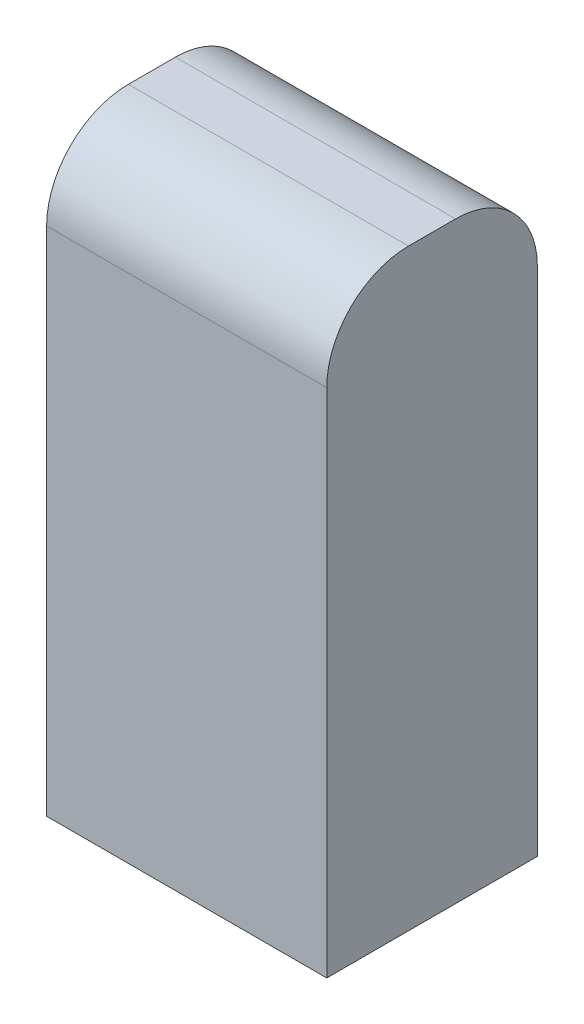
ISO-10303-21;
HEADER;
FILE_DESCRIPTION(('STEP AP214'),'2;1');
FILE_NAME('part.step','',(''),(''),'','','');
FILE_SCHEMA(('AUTOMOTIVE_DESIGN { 1 0 10303 214 1 1 1 1 }'));
ENDSEC;
DATA;
#1=APPLICATION_CONTEXT('core data for automotive mechanical design processes');
#2=APPLICATION_PROTOCOL_DEFINITION('international standard','automotive_design',2000,#1);
#3=PRODUCT_CONTEXT('',#1,'mechanical');
#4=PRODUCT('Part','Part','',(#3));
#5=PRODUCT_RELATED_PRODUCT_CATEGORY('part','',(#4));
#6=PRODUCT_DEFINITION_FORMATION('','',#4);
#7=PRODUCT_DEFINITION_CONTEXT('part definition',#1,'design');
#8=PRODUCT_DEFINITION('design','',#6,#7);
#9=PRODUCT_DEFINITION_SHAPE('','',#8);
#10=(LENGTH_UNIT() NAMED_UNIT(*) SI_UNIT(.MILLI.,.METRE.));
#11=(NAMED_UNIT(*) PLANE_ANGLE_UNIT() SI_UNIT($,.RADIAN.));
#12=(NAMED_UNIT(*) SI_UNIT($,.STERADIAN.) SOLID_ANGLE_UNIT());
#13=UNCERTAINTY_MEASURE_WITH_UNIT(LENGTH_MEASURE(1.E-05),#10,'distance_accuracy_value','');
#14=(GEOMETRIC_REPRESENTATION_CONTEXT(3) GLOBAL_UNCERTAINTY_ASSIGNED_CONTEXT((#13)) GLOBAL_UNIT_ASSIGNED_CONTEXT((#10,
#11,#12)) REPRESENTATION_CONTEXT('',''));
#15=CARTESIAN_POINT('',(0.,0.,0.));
#16=DIRECTION('',(0.,0.,1.));
#17=DIRECTION('',(1.,0.,0.));
#18=AXIS2_PLACEMENT_3D('',#15,#16,#17);
#19=CARTESIAN_POINT('',(17.399,73.66,13.081));
#20=DIRECTION('',(-1.,0.,0.));
#21=DIRECTION('',(0.,0.,1.));
#22=AXIS2_PLACEMENT_3D('',#19,#20,#21);
#23=PLANE('',#22);
#24=DIRECTION('',(0.,-1.,0.));
#25=VECTOR('',#24,1.);
#26=CARTESIAN_POINT('',(17.399,73.66,-13.081));
#27=LINE('',#26,#25);
#28=CARTESIAN_POINT('',(17.399,63.5,-13.081));
#29=VERTEX_POINT('',#28);
#30=CARTESIAN_POINT('',(17.399,0.,-13.081));
#31=VERTEX_POINT('',#30);
#32=EDGE_CURVE('E86',#29,#31,#27,.T.);
#33=ORIENTED_EDGE('',*,*,#32,.F.);
#34=CARTESIAN_POINT('',(17.399,63.5,-2.921));
#35=DIRECTION('',(-1.,0.,0.));
#36=DIRECTION('',(0.,0.,1.));
#37=AXIS2_PLACEMENT_3D('',#34,#35,#36);
#38=CIRCLE('',#37,10.16);
#39=CARTESIAN_POINT('',(17.399,73.66,-2.921));
#40=VERTEX_POINT('',#39);
#41=EDGE_CURVE('E43',#29,#40,#38,.F.);
#42=ORIENTED_EDGE('',*,*,#41,.T.);
#43=DIRECTION('',(0.,0.,-1.));
#44=VECTOR('',#43,1.);
#45=CARTESIAN_POINT('',(17.399,73.66,13.081));
#46=LINE('',#45,#44);
#47=CARTESIAN_POINT('',(17.399,73.66,2.921));
#48=VERTEX_POINT('',#47);
#49=EDGE_CURVE('E114',#48,#40,#46,.T.);
#50=ORIENTED_EDGE('',*,*,#49,.F.);
#51=CARTESIAN_POINT('',(17.399,63.5,2.921));
#52=DIRECTION('',(-1.,0.,0.));
#53=DIRECTION('',(0.,0.,1.));
#54=AXIS2_PLACEMENT_3D('',#51,#52,#53);
#55=CIRCLE('',#54,10.16);
#56=CARTESIAN_POINT('',(17.399,63.5,13.081));
#57=VERTEX_POINT('',#56);
#58=EDGE_CURVE('E50',#48,#57,#55,.F.);
#59=ORIENTED_EDGE('',*,*,#58,.T.);
#60=DIRECTION('',(0.,-1.,0.));
#61=VECTOR('',#60,1.);
#62=CARTESIAN_POINT('',(17.399,73.66,13.081));
#63=LINE('',#62,#61);
#64=CARTESIAN_POINT('',(17.399,0.,13.081));
#65=VERTEX_POINT('',#64);
#66=EDGE_CURVE('E104',#57,#65,#63,.T.);
#67=ORIENTED_EDGE('',*,*,#66,.T.);
#68=DIRECTION('',(0.,0.,-1.));
#69=VECTOR('',#68,1.);
#70=CARTESIAN_POINT('',(17.399,0.,13.081));
#71=LINE('',#70,#69);
#72=EDGE_CURVE('E100',#65,#31,#71,.T.);
#73=ORIENTED_EDGE('',*,*,#72,.T.);
#74=EDGE_LOOP('',(#33,#42,#50,#59,#67,#73));
#75=FACE_BOUND('',#74,.T.);
#76=ADVANCED_FACE('F35',(#75),#23,.F.);
#77=CARTESIAN_POINT('',(-17.399,73.66,-13.081));
#78=DIRECTION('',(0.,0.,1.));
#79=DIRECTION('',(1.,0.,0.));
#80=AXIS2_PLACEMENT_3D('',#77,#78,#79);
#81=PLANE('',#80);
#82=DIRECTION('',(0.,-1.,0.));
#83=VECTOR('',#82,1.);
#84=CARTESIAN_POINT('',(-17.399,73.66,-13.081));
#85=LINE('',#84,#83);
#86=CARTESIAN_POINT('',(-17.399,63.5,-13.081));
#87=VERTEX_POINT('',#86);
#88=CARTESIAN_POINT('',(-17.399,0.,-13.081));
#89=VERTEX_POINT('',#88);
#90=EDGE_CURVE('E94',#87,#89,#85,.T.);
#91=ORIENTED_EDGE('',*,*,#90,.F.);
#92=DIRECTION('',(-1.,0.,0.));
#93=VECTOR('',#92,1.);
#94=CARTESIAN_POINT('',(-17.399,63.5,-13.081));
#95=LINE('',#94,#93);
#96=EDGE_CURVE('E58',#87,#29,#95,.F.);
#97=ORIENTED_EDGE('',*,*,#96,.T.);
#98=ORIENTED_EDGE('',*,*,#32,.T.);
#99=DIRECTION('',(-1.,0.,0.));
#100=VECTOR('',#99,1.);
#101=CARTESIAN_POINT('',(-17.399,0.,-13.081));
#102=LINE('',#101,#100);
#103=EDGE_CURVE('E89',#31,#89,#102,.T.);
#104=ORIENTED_EDGE('',*,*,#103,.T.);
#105=EDGE_LOOP('',(#91,#97,#98,#104));
#106=FACE_BOUND('',#105,.T.);
#107=ADVANCED_FACE('F88',(#106),#81,.F.);
#108=CARTESIAN_POINT('',(-17.399,73.66,13.081));
#109=DIRECTION('',(1.,0.,0.));
#110=DIRECTION('',(0.,0.,-1.));
#111=AXIS2_PLACEMENT_3D('',#108,#109,#110);
#112=PLANE('',#111);
#113=DIRECTION('',(0.,0.,1.));
#114=VECTOR('',#113,1.);
#115=CARTESIAN_POINT('',(-17.399,73.66,13.081));
#116=LINE('',#115,#114);
#117=CARTESIAN_POINT('',(-17.399,73.66,-2.921));
#118=VERTEX_POINT('',#117);
#119=CARTESIAN_POINT('',(-17.399,73.66,2.921));
#120=VERTEX_POINT('',#119);
#121=EDGE_CURVE('E108',#118,#120,#116,.T.);
#122=ORIENTED_EDGE('',*,*,#121,.F.);
#123=CARTESIAN_POINT('',(-17.399,63.5,-2.921));
#124=DIRECTION('',(1.,0.,0.));
#125=DIRECTION('',(0.,0.,-1.));
#126=AXIS2_PLACEMENT_3D('',#123,#124,#125);
#127=CIRCLE('',#126,10.16);
#128=EDGE_CURVE('E126',#118,#87,#127,.F.);
#129=ORIENTED_EDGE('',*,*,#128,.T.);
#130=ORIENTED_EDGE('',*,*,#90,.T.);
#131=DIRECTION('',(0.,0.,1.));
#132=VECTOR('',#131,1.);
#133=CARTESIAN_POINT('',(-17.399,0.,13.081));
#134=LINE('',#133,#132);
#135=CARTESIAN_POINT('',(-17.399,0.,13.081));
#136=VERTEX_POINT('',#135);
#137=EDGE_CURVE('E102',#89,#136,#134,.T.);
#138=ORIENTED_EDGE('',*,*,#137,.T.);
#139=DIRECTION('',(0.,-1.,0.));
#140=VECTOR('',#139,1.);
#141=CARTESIAN_POINT('',(-17.399,73.66,13.081));
#142=LINE('',#141,#140);
#143=CARTESIAN_POINT('',(-17.399,63.5,13.081));
#144=VERTEX_POINT('',#143);
#145=EDGE_CURVE('E116',#144,#136,#142,.T.);
#146=ORIENTED_EDGE('',*,*,#145,.F.);
#147=CARTESIAN_POINT('',(-17.399,63.5,2.921));
#148=DIRECTION('',(1.,0.,0.));
#149=DIRECTION('',(0.,0.,-1.));
#150=AXIS2_PLACEMENT_3D('',#147,#148,#149);
#151=CIRCLE('',#150,10.16);
#152=EDGE_CURVE('E124',#144,#120,#151,.F.);
#153=ORIENTED_EDGE('',*,*,#152,.T.);
#154=EDGE_LOOP('',(#122,#129,#130,#138,#146,#153));
#155=FACE_BOUND('',#154,.T.);
#156=ADVANCED_FACE('F139',(#155),#112,.F.);
#157=CARTESIAN_POINT('',(-17.399,73.66,13.081));
#158=DIRECTION('',(0.,0.,-1.));
#159=DIRECTION('',(-1.,0.,0.));
#160=AXIS2_PLACEMENT_3D('',#157,#158,#159);
#161=PLANE('',#160);
#162=ORIENTED_EDGE('',*,*,#66,.F.);
#163=DIRECTION('',(1.,0.,0.));
#164=VECTOR('',#163,1.);
#165=CARTESIAN_POINT('',(-17.399,63.5,13.081));
#166=LINE('',#165,#164);
#167=EDGE_CURVE('E11',#57,#144,#166,.F.);
#168=ORIENTED_EDGE('',*,*,#167,.T.);
#169=ORIENTED_EDGE('',*,*,#145,.T.);
#170=DIRECTION('',(1.,0.,0.));
#171=VECTOR('',#170,1.);
#172=CARTESIAN_POINT('',(-17.399,0.,13.081));
#173=LINE('',#172,#171);
#174=EDGE_CURVE('E112',#136,#65,#173,.T.);
#175=ORIENTED_EDGE('',*,*,#174,.T.);
#176=EDGE_LOOP('',(#162,#168,#169,#175));
#177=FACE_BOUND('',#176,.T.);
#178=ADVANCED_FACE('F145',(#177),#161,.F.);
#179=CARTESIAN_POINT('',(0.,73.66,0.));
#180=DIRECTION('',(0.,-1.,0.));
#181=DIRECTION('',(0.,0.,-1.));
#182=AXIS2_PLACEMENT_3D('',#179,#180,#181);
#183=PLANE('',#182);
#184=ORIENTED_EDGE('',*,*,#49,.T.);
#185=DIRECTION('',(-1.,0.,0.));
#186=VECTOR('',#185,1.);
#187=CARTESIAN_POINT('',(0.,73.66,-2.921));
#188=LINE('',#187,#186);
#189=EDGE_CURVE('E121',#40,#118,#188,.T.);
#190=ORIENTED_EDGE('',*,*,#189,.T.);
#191=ORIENTED_EDGE('',*,*,#121,.T.);
#192=DIRECTION('',(1.,0.,0.));
#193=VECTOR('',#192,1.);
#194=CARTESIAN_POINT('',(0.,73.66,2.921));
#195=LINE('',#194,#193);
#196=EDGE_CURVE('E93',#120,#48,#195,.T.);
#197=ORIENTED_EDGE('',*,*,#196,.T.);
#198=EDGE_LOOP('',(#184,#190,#191,#197));
#199=FACE_BOUND('',#198,.T.);
#200=ADVANCED_FACE('F133',(#199),#183,.F.);
#201=CARTESIAN_POINT('',(0.,0.,0.));
#202=DIRECTION('',(0.,-1.,0.));
#203=DIRECTION('',(0.,0.,-1.));
#204=AXIS2_PLACEMENT_3D('',#201,#202,#203);
#205=PLANE('',#204);
#206=ORIENTED_EDGE('',*,*,#72,.F.);
#207=ORIENTED_EDGE('',*,*,#174,.F.);
#208=ORIENTED_EDGE('',*,*,#137,.F.);
#209=ORIENTED_EDGE('',*,*,#103,.F.);
#210=EDGE_LOOP('',(#206,#207,#208,#209));
#211=FACE_BOUND('',#210,.T.);
#212=ADVANCED_FACE('F98',(#211),#205,.T.);
#213=CARTESIAN_POINT('',(0.,63.5,-2.921));
#214=DIRECTION('',(-1.,0.,0.));
#215=DIRECTION('',(0.,0.,1.));
#216=AXIS2_PLACEMENT_3D('',#213,#214,#215);
#217=CYLINDRICAL_SURFACE('',#216,10.16);
#218=ORIENTED_EDGE('',*,*,#41,.F.);
#219=ORIENTED_EDGE('',*,*,#96,.F.);
#220=ORIENTED_EDGE('',*,*,#128,.F.);
#221=ORIENTED_EDGE('',*,*,#189,.F.);
#222=EDGE_LOOP('',(#218,#219,#220,#221));
#223=FACE_BOUND('',#222,.T.);
#224=ADVANCED_FACE('F137',(#223),#217,.T.);
#225=CARTESIAN_POINT('',(0.,63.5,2.921));
#226=DIRECTION('',(1.,0.,0.));
#227=DIRECTION('',(0.,0.,-1.));
#228=AXIS2_PLACEMENT_3D('',#225,#226,#227);
#229=CYLINDRICAL_SURFACE('',#228,10.16);
#230=ORIENTED_EDGE('',*,*,#152,.F.);
#231=ORIENTED_EDGE('',*,*,#167,.F.);
#232=ORIENTED_EDGE('',*,*,#58,.F.);
#233=ORIENTED_EDGE('',*,*,#196,.F.);
#234=EDGE_LOOP('',(#230,#231,#232,#233));
#235=FACE_BOUND('',#234,.T.);
#236=ADVANCED_FACE('F37',(#235),#229,.T.);
#237=CLOSED_SHELL('',(#76,#107,#156,#178,#200,#212,#224,#236));
#238=MANIFOLD_SOLID_BREP('B2',#237);
#239=ADVANCED_BREP_SHAPE_REPRESENTATION('',(#18,#238),#14);
#240=SHAPE_DEFINITION_REPRESENTATION(#9,#239);
ENDSEC;
END-ISO-10303-21;
